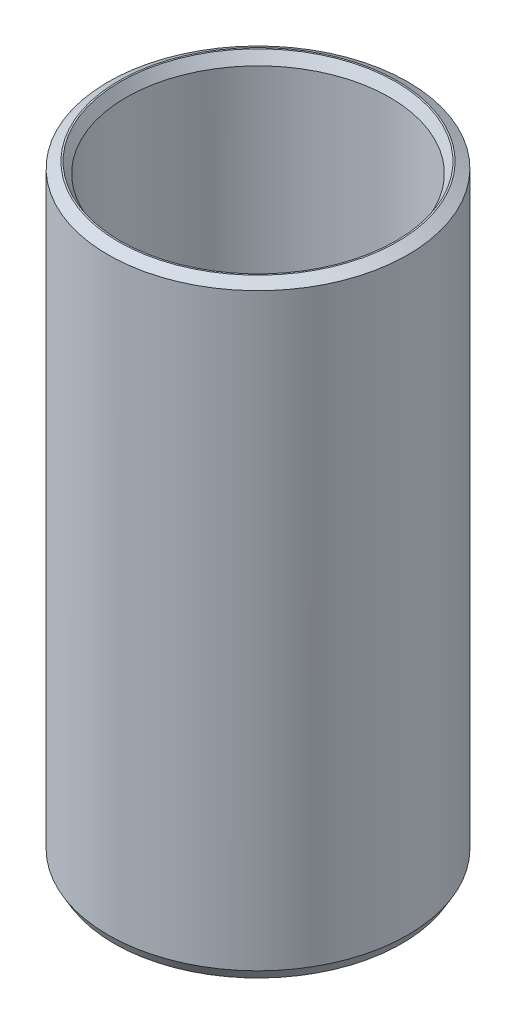
ISO-10303-21;
HEADER;
FILE_DESCRIPTION(('STEP AP214'),'2;1');
FILE_NAME('part.step','',(''),(''),'','','');
FILE_SCHEMA(('AUTOMOTIVE_DESIGN { 1 0 10303 214 1 1 1 1 }'));
ENDSEC;
DATA;
#1=APPLICATION_CONTEXT('core data for automotive mechanical design processes');
#2=APPLICATION_PROTOCOL_DEFINITION('international standard','automotive_design',2000,#1);
#3=PRODUCT_CONTEXT('',#1,'mechanical');
#4=PRODUCT('Part','Part','',(#3));
#5=PRODUCT_RELATED_PRODUCT_CATEGORY('part','',(#4));
#6=PRODUCT_DEFINITION_FORMATION('','',#4);
#7=PRODUCT_DEFINITION_CONTEXT('part definition',#1,'design');
#8=PRODUCT_DEFINITION('design','',#6,#7);
#9=PRODUCT_DEFINITION_SHAPE('','',#8);
#10=(LENGTH_UNIT() NAMED_UNIT(*) SI_UNIT(.MILLI.,.METRE.));
#11=(NAMED_UNIT(*) PLANE_ANGLE_UNIT() SI_UNIT($,.RADIAN.));
#12=(NAMED_UNIT(*) SI_UNIT($,.STERADIAN.) SOLID_ANGLE_UNIT());
#13=UNCERTAINTY_MEASURE_WITH_UNIT(LENGTH_MEASURE(1.E-05),#10,'distance_accuracy_value','');
#14=(GEOMETRIC_REPRESENTATION_CONTEXT(3) GLOBAL_UNCERTAINTY_ASSIGNED_CONTEXT((#13)) GLOBAL_UNIT_ASSIGNED_CONTEXT((#10,
#11,#12)) REPRESENTATION_CONTEXT('',''));
#15=CARTESIAN_POINT('',(0.,0.,0.));
#16=DIRECTION('',(0.,0.,1.));
#17=DIRECTION('',(1.,0.,0.));
#18=AXIS2_PLACEMENT_3D('',#15,#16,#17);
#19=CARTESIAN_POINT('',(0.,222.255829095445,0.));
#20=DIRECTION('',(0.,-1.,0.));
#21=DIRECTION('',(0.,0.,-1.));
#22=AXIS2_PLACEMENT_3D('',#19,#20,#21);
#23=CYLINDRICAL_SURFACE('',#22,55.);
#24=CARTESIAN_POINT('',(0.,3.84474571850932,0.));
#25=DIRECTION('',(0.,1.,0.));
#26=DIRECTION('',(0.,0.,1.));
#27=AXIS2_PLACEMENT_3D('',#24,#25,#26);
#28=CIRCLE('',#27,55.);
#29=CARTESIAN_POINT('',(0.,3.84474571850929,-55.));
#30=VERTEX_POINT('',#29);
#31=EDGE_CURVE('E10',#30,#30,#28,.T.);
#32=CARTESIAN_POINT('',(0.,220.036064119898,0.));
#33=DIRECTION('',(0.,1.,0.));
#34=DIRECTION('',(0.,0.,1.));
#35=AXIS2_PLACEMENT_3D('',#32,#33,#34);
#36=CIRCLE('',#35,55.);
#37=CARTESIAN_POINT('',(0.,220.036064119898,-55.));
#38=VERTEX_POINT('',#37);
#39=EDGE_CURVE('E50',#38,#38,#36,.F.);
#40=CARTESIAN_POINT('',(0.,3.84474571850929,-55.));
#41=CARTESIAN_POINT('',(0.,6.09673861852376,-55.));
#42=CARTESIAN_POINT('',(0.,8.34873151853823,-55.));
#43=CARTESIAN_POINT('',(0.,12.8527173185672,-55.));
#44=CARTESIAN_POINT('',(0.,15.1047102185816,-55.));
#45=CARTESIAN_POINT('',(0.,19.6086960186105,-55.));
#46=CARTESIAN_POINT('',(0.,21.860688918625,-55.));
#47=CARTESIAN_POINT('',(0.,26.364674718654,-55.));
#48=CARTESIAN_POINT('',(0.,28.6166676186684,-55.));
#49=CARTESIAN_POINT('',(0.,33.1206534186974,-55.));
#50=CARTESIAN_POINT('',(0.,35.3726463187118,-55.));
#51=CARTESIAN_POINT('',(0.,39.8766321187407,-55.));
#52=CARTESIAN_POINT('',(0.,42.1286250187552,-55.));
#53=CARTESIAN_POINT('',(0.,46.6326108187842,-55.));
#54=CARTESIAN_POINT('',(0.,48.8846037187986,-55.));
#55=CARTESIAN_POINT('',(0.,53.3885895188276,-55.));
#56=CARTESIAN_POINT('',(0.,55.640582418842,-55.));
#57=CARTESIAN_POINT('',(0.,60.144568218871,-55.));
#58=CARTESIAN_POINT('',(0.,62.3965611188854,-55.));
#59=CARTESIAN_POINT('',(0.,66.9005469189144,-55.));
#60=CARTESIAN_POINT('',(0.,69.1525398189288,-55.));
#61=CARTESIAN_POINT('',(0.,73.6565256189577,-55.));
#62=CARTESIAN_POINT('',(0.,75.9085185189722,-55.));
#63=CARTESIAN_POINT('',(0.,80.4125043190011,-55.));
#64=CARTESIAN_POINT('',(0.,82.6644972190156,-55.));
#65=CARTESIAN_POINT('',(0.,87.1684830190445,-55.));
#66=CARTESIAN_POINT('',(0.,89.420475919059,-55.));
#67=CARTESIAN_POINT('',(0.,93.9244617190879,-55.));
#68=CARTESIAN_POINT('',(0.,96.1764546191024,-55.));
#69=CARTESIAN_POINT('',(0.,100.680440419131,-55.));
#70=CARTESIAN_POINT('',(0.,102.932433319146,-55.));
#71=CARTESIAN_POINT('',(0.,107.436419119175,-55.));
#72=CARTESIAN_POINT('',(0.,109.688412019189,-55.));
#73=CARTESIAN_POINT('',(0.,114.192397819218,-55.));
#74=CARTESIAN_POINT('',(0.,116.444390719233,-55.));
#75=CARTESIAN_POINT('',(0.,120.948376519262,-55.));
#76=CARTESIAN_POINT('',(0.,123.200369419276,-55.));
#77=CARTESIAN_POINT('',(0.,127.704355219305,-55.));
#78=CARTESIAN_POINT('',(0.,129.956348119319,-55.));
#79=CARTESIAN_POINT('',(0.,134.460333919348,-55.));
#80=CARTESIAN_POINT('',(0.,136.712326819363,-55.));
#81=CARTESIAN_POINT('',(0.,141.216312619392,-55.));
#82=CARTESIAN_POINT('',(0.,143.468305519406,-55.));
#83=CARTESIAN_POINT('',(0.,147.972291319435,-55.));
#84=CARTESIAN_POINT('',(0.,150.22428421945,-55.));
#85=CARTESIAN_POINT('',(0.,154.728270019479,-55.));
#86=CARTESIAN_POINT('',(0.,156.980262919493,-55.));
#87=CARTESIAN_POINT('',(0.,161.484248719522,-55.));
#88=CARTESIAN_POINT('',(0.,163.736241619536,-55.));
#89=CARTESIAN_POINT('',(0.,168.240227419565,-55.));
#90=CARTESIAN_POINT('',(0.,170.49222031958,-55.));
#91=CARTESIAN_POINT('',(0.,174.996206119609,-55.));
#92=CARTESIAN_POINT('',(0.,177.248199019623,-55.));
#93=CARTESIAN_POINT('',(0.,181.752184819652,-55.));
#94=CARTESIAN_POINT('',(0.,184.004177719667,-55.));
#95=CARTESIAN_POINT('',(0.,188.508163519696,-55.));
#96=CARTESIAN_POINT('',(0.,190.76015641971,-55.));
#97=CARTESIAN_POINT('',(0.,195.264142219739,-55.));
#98=CARTESIAN_POINT('',(0.,197.516135119753,-55.));
#99=CARTESIAN_POINT('',(0.,202.020120919782,-55.));
#100=CARTESIAN_POINT('',(0.,204.272113819797,-55.));
#101=CARTESIAN_POINT('',(0.,208.776099619826,-55.));
#102=CARTESIAN_POINT('',(0.,211.02809251984,-55.));
#103=CARTESIAN_POINT('',(0.,215.532078319869,-55.));
#104=CARTESIAN_POINT('',(0.,217.784071219884,-55.));
#105=CARTESIAN_POINT('',(0.,220.036064119898,-55.));
#106=B_SPLINE_CURVE_WITH_KNOTS('',3,(#40,#41,#42,#43,#44,#45,#46,#47,#48,#49,#50,#51,#52,#53,
#54,#55,#56,#57,#58,#59,#60,#61,#62,#63,#64,#65,#66,#67,#68,#69,#70,#71,#72,#73,#74,#75,#76,#77,
#78,#79,#80,#81,#82,#83,#84,#85,#86,#87,#88,#89,#90,#91,#92,#93,#94,#95,#96,#97,#98,#99,#100,
#101,#102,#103,#104,#105),.UNSPECIFIED.,.F.,.F.,(4,2,2,2,2,2,2,2,2,2,2,2,2,2,2,2,2,2,2,2,2,2,2,
2,2,2,2,2,2,2,2,2,4),(0.,6.75597870004341,13.5119574000868,20.2679361001302,27.0239148001736,
33.779893500217,40.5358722002604,47.2918509003038,54.0478296003472,60.8038083003906,
67.559787000434,74.3157657004774,81.0717444005208,87.8277231005642,94.5837018006076,
101.339680500651,108.095659200694,114.851637900738,121.607616600781,128.363595300825,
135.119574000868,141.875552700911,148.631531400955,155.387510100998,162.143488801042,
168.899467501085,175.655446201128,182.411424901172,189.167403601215,195.923382301259,
202.679361001302,209.435339701345,216.191318401389),.UNSPECIFIED.);
#107=EDGE_CURVE('BSEAM39',#30,#38,#106,.T.);
#108=ORIENTED_EDGE('',*,*,#31,.T.);
#109=ORIENTED_EDGE('',*,*,#39,.T.);
#110=ORIENTED_EDGE('',*,*,#107,.T.);
#111=ORIENTED_EDGE('',*,*,#107,.F.);
#112=EDGE_LOOP('',(#108,#110,#109,#111));
#113=FACE_BOUND('',#112,.T.);
#114=ADVANCED_FACE('F39',(#113),#23,.T.);
#115=CARTESIAN_POINT('',(0.,222.255829095445,0.));
#116=DIRECTION('',(0.,1.,0.));
#117=DIRECTION('',(0.,0.,1.));
#118=AXIS2_PLACEMENT_3D('',#115,#116,#117);
#119=PLANE('',#118);
#120=CARTESIAN_POINT('',(0.,222.255829095445,0.));
#121=DIRECTION('',(0.,1.,0.));
#122=DIRECTION('',(0.,0.,1.));
#123=AXIS2_PLACEMENT_3D('',#120,#121,#122);
#124=CIRCLE('',#123,50.5993965376709);
#125=CARTESIAN_POINT('',(0.,222.255829095445,50.5993965376709));
#126=VERTEX_POINT('',#125);
#127=EDGE_CURVE('E58',#126,#126,#124,.F.);
#128=ORIENTED_EDGE('',*,*,#127,.T.);
#129=EDGE_LOOP('',(#128));
#130=FACE_BOUND('',#129,.T.);
#131=CARTESIAN_POINT('',(0.,222.255829095445,0.));
#132=DIRECTION('',(0.,1.,0.));
#133=DIRECTION('',(0.,0.,1.));
#134=AXIS2_PLACEMENT_3D('',#131,#132,#133);
#135=CIRCLE('',#134,51.1552542814912);
#136=CARTESIAN_POINT('',(0.,222.255829095445,51.1552542814912));
#137=VERTEX_POINT('',#136);
#138=EDGE_CURVE('E61',#137,#137,#135,.T.);
#139=ORIENTED_EDGE('',*,*,#138,.T.);
#140=EDGE_LOOP('',(#139));
#141=FACE_BOUND('',#140,.T.);
#142=ADVANCED_FACE('F88',(#130,#141),#119,.T.);
#143=CARTESIAN_POINT('',(0.,0.,0.));
#144=DIRECTION('',(0.,1.,0.));
#145=DIRECTION('',(0.,0.,1.));
#146=AXIS2_PLACEMENT_3D('',#143,#144,#145);
#147=PLANE('',#146);
#148=CARTESIAN_POINT('',(0.,0.,0.));
#149=DIRECTION('',(0.,1.,0.));
#150=DIRECTION('',(0.,0.,1.));
#151=AXIS2_PLACEMENT_3D('',#148,#149,#150);
#152=CIRCLE('',#151,52.2243772806329);
#153=CARTESIAN_POINT('',(0.,0.,52.2243772806329));
#154=VERTEX_POINT('',#153);
#155=EDGE_CURVE('E51',#154,#154,#152,.T.);
#156=ORIENTED_EDGE('',*,*,#155,.T.);
#157=EDGE_LOOP('',(#156));
#158=FACE_BOUND('',#157,.T.);
#159=CARTESIAN_POINT('',(0.,0.,0.));
#160=DIRECTION('',(0.,1.,0.));
#161=DIRECTION('',(0.,0.,1.));
#162=AXIS2_PLACEMENT_3D('',#159,#160,#161);
#163=CIRCLE('',#162,52.780235024453);
#164=CARTESIAN_POINT('',(0.,0.,52.780235024453));
#165=VERTEX_POINT('',#164);
#166=EDGE_CURVE('E54',#165,#165,#163,.F.);
#167=ORIENTED_EDGE('',*,*,#166,.T.);
#168=EDGE_LOOP('',(#167));
#169=FACE_BOUND('',#168,.T.);
#170=ADVANCED_FACE('F83',(#158,#169),#147,.F.);
#171=CARTESIAN_POINT('',(0.,222.255829095445,0.));
#172=DIRECTION('',(0.,-1.,0.));
#173=DIRECTION('',(0.,0.,-1.));
#174=AXIS2_PLACEMENT_3D('',#171,#172,#173);
#175=CYLINDRICAL_SURFACE('',#174,48.379631562124);
#176=CARTESIAN_POINT('',(0.,218.411083376936,0.));
#177=DIRECTION('',(0.,1.,0.));
#178=DIRECTION('',(0.,0.,1.));
#179=AXIS2_PLACEMENT_3D('',#176,#177,#178);
#180=CIRCLE('',#179,48.379631562124);
#181=CARTESIAN_POINT('',(0.,218.411083376936,-48.379631562124));
#182=VERTEX_POINT('',#181);
#183=EDGE_CURVE('E67',#182,#182,#180,.T.);
#184=CARTESIAN_POINT('',(0.,2.21976497554679,0.));
#185=DIRECTION('',(0.,1.,0.));
#186=DIRECTION('',(0.,0.,1.));
#187=AXIS2_PLACEMENT_3D('',#184,#185,#186);
#188=CIRCLE('',#187,48.379631562124);
#189=CARTESIAN_POINT('',(0.,2.21976497554677,-48.379631562124));
#190=VERTEX_POINT('',#189);
#191=EDGE_CURVE('E69',#190,#190,#188,.F.);
#192=CARTESIAN_POINT('',(0.,218.411083376936,-48.379631562124));
#193=CARTESIAN_POINT('',(0.,216.159090476921,-48.379631562124));
#194=CARTESIAN_POINT('',(0.,213.907097576907,-48.379631562124));
#195=CARTESIAN_POINT('',(0.,209.403111776878,-48.379631562124));
#196=CARTESIAN_POINT('',(0.,207.151118876863,-48.379631562124));
#197=CARTESIAN_POINT('',(0.,202.647133076834,-48.379631562124));
#198=CARTESIAN_POINT('',(0.,200.39514017682,-48.379631562124));
#199=CARTESIAN_POINT('',(0.,195.891154376791,-48.379631562124));
#200=CARTESIAN_POINT('',(0.,193.639161476777,-48.379631562124));
#201=CARTESIAN_POINT('',(0.,189.135175676748,-48.379631562124));
#202=CARTESIAN_POINT('',(0.,186.883182776733,-48.379631562124));
#203=CARTESIAN_POINT('',(0.,182.379196976704,-48.379631562124));
#204=CARTESIAN_POINT('',(0.,180.12720407669,-48.379631562124));
#205=CARTESIAN_POINT('',(0.,175.623218276661,-48.379631562124));
#206=CARTESIAN_POINT('',(0.,173.371225376646,-48.379631562124));
#207=CARTESIAN_POINT('',(0.,168.867239576617,-48.379631562124));
#208=CARTESIAN_POINT('',(0.,166.615246676603,-48.379631562124));
#209=CARTESIAN_POINT('',(0.,162.111260876574,-48.379631562124));
#210=CARTESIAN_POINT('',(0.,159.859267976559,-48.379631562124));
#211=CARTESIAN_POINT('',(0.,155.355282176531,-48.379631562124));
#212=CARTESIAN_POINT('',(0.,153.103289276516,-48.379631562124));
#213=CARTESIAN_POINT('',(0.,148.599303476487,-48.379631562124));
#214=CARTESIAN_POINT('',(0.,146.347310576473,-48.379631562124));
#215=CARTESIAN_POINT('',(0.,141.843324776444,-48.379631562124));
#216=CARTESIAN_POINT('',(0.,139.591331876429,-48.379631562124));
#217=CARTESIAN_POINT('',(0.,135.0873460764,-48.379631562124));
#218=CARTESIAN_POINT('',(0.,132.835353176386,-48.379631562124));
#219=CARTESIAN_POINT('',(0.,128.331367376357,-48.379631562124));
#220=CARTESIAN_POINT('',(0.,126.079374476342,-48.379631562124));
#221=CARTESIAN_POINT('',(0.,121.575388676314,-48.379631562124));
#222=CARTESIAN_POINT('',(0.,119.323395776299,-48.379631562124));
#223=CARTESIAN_POINT('',(0.,114.81940997627,-48.379631562124));
#224=CARTESIAN_POINT('',(0.,112.567417076256,-48.379631562124));
#225=CARTESIAN_POINT('',(0.,108.063431276227,-48.379631562124));
#226=CARTESIAN_POINT('',(0.,105.811438376212,-48.379631562124));
#227=CARTESIAN_POINT('',(0.,101.307452576183,-48.379631562124));
#228=CARTESIAN_POINT('',(0.,99.0554596761689,-48.379631562124));
#229=CARTESIAN_POINT('',(0.,94.55147387614,-48.379631562124));
#230=CARTESIAN_POINT('',(0.,92.2994809761255,-48.379631562124));
#231=CARTESIAN_POINT('',(0.,87.7954951760965,-48.379631562124));
#232=CARTESIAN_POINT('',(0.,85.5435022760821,-48.379631562124));
#233=CARTESIAN_POINT('',(0.,81.0395164760531,-48.379631562124));
#234=CARTESIAN_POINT('',(0.,78.7875235760387,-48.379631562124));
#235=CARTESIAN_POINT('',(0.,74.2835377760097,-48.379631562124));
#236=CARTESIAN_POINT('',(0.,72.0315448759953,-48.379631562124));
#237=CARTESIAN_POINT('',(0.,67.5275590759663,-48.379631562124));
#238=CARTESIAN_POINT('',(0.,65.2755661759519,-48.379631562124));
#239=CARTESIAN_POINT('',(0.,60.7715803759229,-48.379631562124));
#240=CARTESIAN_POINT('',(0.,58.5195874759084,-48.379631562124));
#241=CARTESIAN_POINT('',(0.,54.0156016758795,-48.379631562124));
#242=CARTESIAN_POINT('',(0.,51.763608775865,-48.379631562124));
#243=CARTESIAN_POINT('',(0.,47.2596229758361,-48.379631562124));
#244=CARTESIAN_POINT('',(0.,45.0076300758216,-48.379631562124));
#245=CARTESIAN_POINT('',(0.,40.5036442757927,-48.379631562124));
#246=CARTESIAN_POINT('',(0.,38.2516513757782,-48.379631562124));
#247=CARTESIAN_POINT('',(0.,33.7476655757493,-48.379631562124));
#248=CARTESIAN_POINT('',(0.,31.4956726757349,-48.379631562124));
#249=CARTESIAN_POINT('',(0.,26.9916868757059,-48.379631562124));
#250=CARTESIAN_POINT('',(0.,24.7396939756915,-48.379631562124));
#251=CARTESIAN_POINT('',(0.,20.2357081756625,-48.379631562124));
#252=CARTESIAN_POINT('',(0.,17.9837152756481,-48.379631562124));
#253=CARTESIAN_POINT('',(0.,13.4797294756191,-48.379631562124));
#254=CARTESIAN_POINT('',(0.,11.2277365756046,-48.379631562124));
#255=CARTESIAN_POINT('',(0.,6.72375077557571,-48.379631562124));
#256=CARTESIAN_POINT('',(0.,4.47175787556124,-48.379631562124));
#257=CARTESIAN_POINT('',(0.,2.21976497554677,-48.379631562124));
#258=B_SPLINE_CURVE_WITH_KNOTS('',3,(#192,#193,#194,#195,#196,#197,#198,#199,#200,#201,#202,
#203,#204,#205,#206,#207,#208,#209,#210,#211,#212,#213,#214,#215,#216,#217,#218,#219,#220,#221,
#222,#223,#224,#225,#226,#227,#228,#229,#230,#231,#232,#233,#234,#235,#236,#237,#238,#239,#240,
#241,#242,#243,#244,#245,#246,#247,#248,#249,#250,#251,#252,#253,#254,#255,#256,#257),
.UNSPECIFIED.,.F.,.F.,(4,2,2,2,2,2,2,2,2,2,2,2,2,2,2,2,2,2,2,2,2,2,2,2,2,2,2,2,2,2,2,2,4),(0.,
6.75597870004341,13.5119574000868,20.2679361001302,27.0239148001736,33.779893500217,
40.5358722002604,47.2918509003038,54.0478296003472,60.8038083003906,67.5597870004341,
74.3157657004775,81.0717444005209,87.8277231005643,94.5837018006077,101.339680500651,
108.095659200694,114.851637900738,121.607616600781,128.363595300825,135.119574000868,
141.875552700911,148.631531400955,155.387510100998,162.143488801042,168.899467501085,
175.655446201129,182.411424901172,189.167403601215,195.923382301259,202.679361001302,
209.435339701345,216.191318401389),.UNSPECIFIED.);
#259=EDGE_CURVE('BSEAM71',#182,#190,#258,.T.);
#260=ORIENTED_EDGE('',*,*,#183,.T.);
#261=ORIENTED_EDGE('',*,*,#191,.T.);
#262=ORIENTED_EDGE('',*,*,#259,.T.);
#263=ORIENTED_EDGE('',*,*,#259,.F.);
#264=EDGE_LOOP('',(#260,#262,#261,#263));
#265=FACE_BOUND('',#264,.T.);
#266=ADVANCED_FACE('F71',(#265),#175,.F.);
#267=CARTESIAN_POINT('',(0.,218.411083376936,0.));
#268=DIRECTION('',(0.,1.,0.));
#269=DIRECTION('',(0.,0.,1.));
#270=AXIS2_PLACEMENT_3D('',#267,#268,#269);
#271=CONICAL_SURFACE('',#270,48.379631562124,0.523598775598299);
#272=ORIENTED_EDGE('',*,*,#127,.F.);
#273=EDGE_LOOP('',(#272));
#274=FACE_BOUND('',#273,.T.);
#275=ORIENTED_EDGE('',*,*,#183,.F.);
#276=EDGE_LOOP('',(#275));
#277=FACE_BOUND('',#276,.T.);
#278=ADVANCED_FACE('F77',(#274,#277),#271,.F.);
#279=CARTESIAN_POINT('',(0.,0.,0.));
#280=DIRECTION('',(0.,-1.,0.));
#281=DIRECTION('',(0.,0.,-1.));
#282=AXIS2_PLACEMENT_3D('',#279,#280,#281);
#283=CONICAL_SURFACE('',#282,52.2243772806329,1.04719755119659);
#284=ORIENTED_EDGE('',*,*,#191,.F.);
#285=EDGE_LOOP('',(#284));
#286=FACE_BOUND('',#285,.T.);
#287=ORIENTED_EDGE('',*,*,#155,.F.);
#288=EDGE_LOOP('',(#287));
#289=FACE_BOUND('',#288,.T.);
#290=ADVANCED_FACE('F73',(#286,#289),#283,.F.);
#291=CARTESIAN_POINT('',(0.,3.84474571850932,0.));
#292=DIRECTION('',(0.,1.,0.));
#293=DIRECTION('',(0.,0.,1.));
#294=AXIS2_PLACEMENT_3D('',#291,#292,#293);
#295=CONICAL_SURFACE('',#294,55.,0.523598775598304);
#296=ORIENTED_EDGE('',*,*,#166,.F.);
#297=EDGE_LOOP('',(#296));
#298=FACE_BOUND('',#297,.T.);
#299=ORIENTED_EDGE('',*,*,#31,.F.);
#300=EDGE_LOOP('',(#299));
#301=FACE_BOUND('',#300,.T.);
#302=ADVANCED_FACE('F76',(#298,#301),#295,.T.);
#303=CARTESIAN_POINT('',(0.,222.255829095445,0.));
#304=DIRECTION('',(0.,-1.,0.));
#305=DIRECTION('',(0.,0.,-1.));
#306=AXIS2_PLACEMENT_3D('',#303,#304,#305);
#307=CONICAL_SURFACE('',#306,51.1552542814912,1.04719755119659);
#308=ORIENTED_EDGE('',*,*,#39,.F.);
#309=EDGE_LOOP('',(#308));
#310=FACE_BOUND('',#309,.T.);
#311=ORIENTED_EDGE('',*,*,#138,.F.);
#312=EDGE_LOOP('',(#311));
#313=FACE_BOUND('',#312,.T.);
#314=ADVANCED_FACE('F45',(#310,#313),#307,.T.);
#315=CLOSED_SHELL('',(#114,#142,#170,#266,#278,#290,#302,#314));
#316=MANIFOLD_SOLID_BREP('B2',#315);
#317=ADVANCED_BREP_SHAPE_REPRESENTATION('',(#18,#316),#14);
#318=SHAPE_DEFINITION_REPRESENTATION(#9,#317);
ENDSEC;
END-ISO-10303-21;
